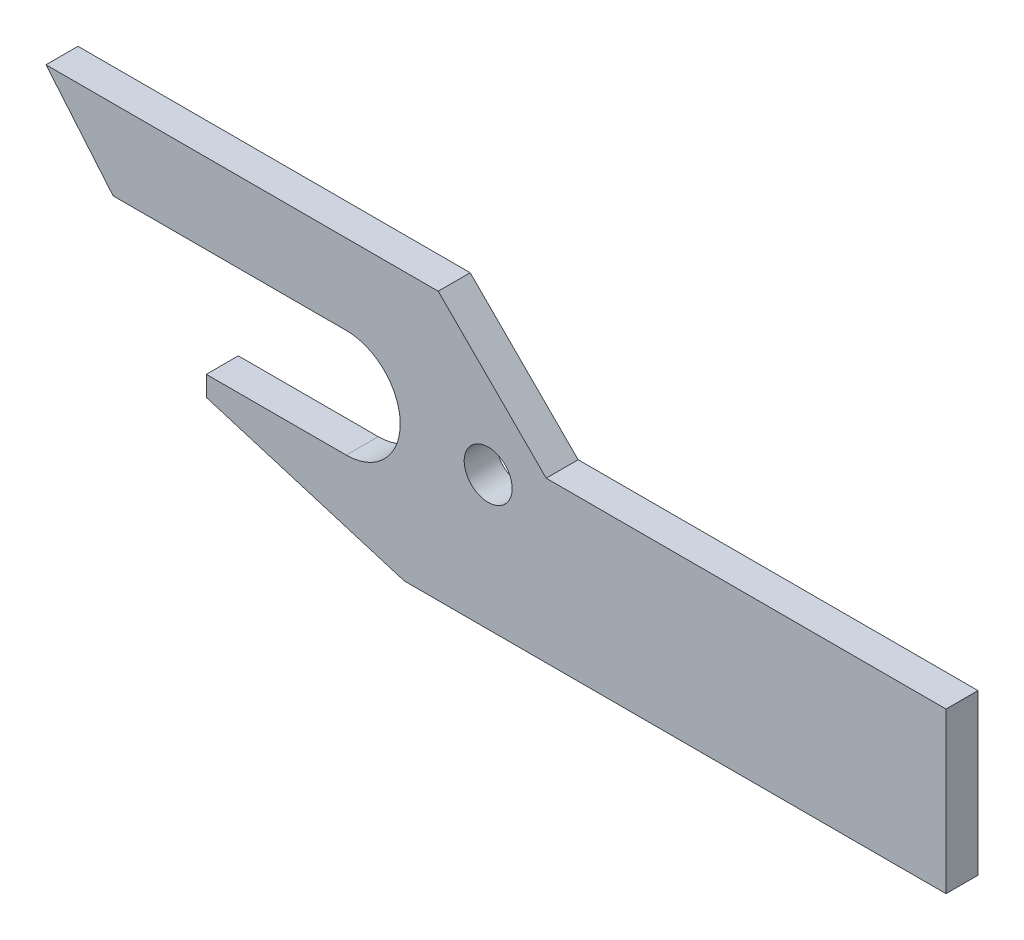
ISO-10303-21;
HEADER;
FILE_DESCRIPTION(('STEP AP214'),'2;1');
FILE_NAME('part.step','',(''),(''),'','','');
FILE_SCHEMA(('AUTOMOTIVE_DESIGN { 1 0 10303 214 1 1 1 1 }'));
ENDSEC;
DATA;
#1=APPLICATION_CONTEXT('core data for automotive mechanical design processes');
#2=APPLICATION_PROTOCOL_DEFINITION('international standard','automotive_design',2000,#1);
#3=PRODUCT_CONTEXT('',#1,'mechanical');
#4=PRODUCT('Part','Part','',(#3));
#5=PRODUCT_RELATED_PRODUCT_CATEGORY('part','',(#4));
#6=PRODUCT_DEFINITION_FORMATION('','',#4);
#7=PRODUCT_DEFINITION_CONTEXT('part definition',#1,'design');
#8=PRODUCT_DEFINITION('design','',#6,#7);
#9=PRODUCT_DEFINITION_SHAPE('','',#8);
#10=(LENGTH_UNIT() NAMED_UNIT(*) SI_UNIT(.MILLI.,.METRE.));
#11=(NAMED_UNIT(*) PLANE_ANGLE_UNIT() SI_UNIT($,.RADIAN.));
#12=(NAMED_UNIT(*) SI_UNIT($,.STERADIAN.) SOLID_ANGLE_UNIT());
#13=UNCERTAINTY_MEASURE_WITH_UNIT(LENGTH_MEASURE(1.E-05),#10,'distance_accuracy_value','');
#14=(GEOMETRIC_REPRESENTATION_CONTEXT(3) GLOBAL_UNCERTAINTY_ASSIGNED_CONTEXT((#13)) GLOBAL_UNIT_ASSIGNED_CONTEXT((#10,
#11,#12)) REPRESENTATION_CONTEXT('',''));
#15=CARTESIAN_POINT('',(0.,0.,0.));
#16=DIRECTION('',(0.,0.,1.));
#17=DIRECTION('',(1.,0.,0.));
#18=AXIS2_PLACEMENT_3D('',#15,#16,#17);
#19=CARTESIAN_POINT('',(-35.,-18.5,-8.));
#20=DIRECTION('',(-1.,0.,0.));
#21=DIRECTION('',(0.,-1.,0.));
#22=AXIS2_PLACEMENT_3D('',#19,#20,#21);
#23=PLANE('',#22);
#24=DIRECTION('',(0.,-1.,0.));
#25=VECTOR('',#24,1.);
#26=CARTESIAN_POINT('',(-35.,-18.5,0.));
#27=LINE('',#26,#25);
#28=CARTESIAN_POINT('',(-35.,-13.5,0.));
#29=VERTEX_POINT('',#28);
#30=CARTESIAN_POINT('',(-35.,-18.5,0.));
#31=VERTEX_POINT('',#30);
#32=EDGE_CURVE('E152',#29,#31,#27,.T.);
#33=ORIENTED_EDGE('',*,*,#32,.F.);
#34=DIRECTION('',(0.,0.,1.));
#35=VECTOR('',#34,1.);
#36=CARTESIAN_POINT('',(-35.,-13.5,-8.));
#37=LINE('',#36,#35);
#38=CARTESIAN_POINT('',(-35.,-13.5,-8.));
#39=VERTEX_POINT('',#38);
#40=EDGE_CURVE('E11',#39,#29,#37,.T.);
#41=ORIENTED_EDGE('',*,*,#40,.F.);
#42=DIRECTION('',(0.,-1.,0.));
#43=VECTOR('',#42,1.);
#44=CARTESIAN_POINT('',(-35.,-18.5,-8.));
#45=LINE('',#44,#43);
#46=CARTESIAN_POINT('',(-35.,-18.5,-8.));
#47=VERTEX_POINT('',#46);
#48=EDGE_CURVE('E182',#39,#47,#45,.T.);
#49=ORIENTED_EDGE('',*,*,#48,.T.);
#50=DIRECTION('',(0.,0.,1.));
#51=VECTOR('',#50,1.);
#52=CARTESIAN_POINT('',(-35.,-18.5,-8.));
#53=LINE('',#52,#51);
#54=EDGE_CURVE('E40',#47,#31,#53,.T.);
#55=ORIENTED_EDGE('',*,*,#54,.T.);
#56=EDGE_LOOP('',(#33,#41,#49,#55));
#57=FACE_BOUND('',#56,.T.);
#58=ADVANCED_FACE('F37',(#57),#23,.T.);
#59=CARTESIAN_POINT('',(-35.,-13.5,-8.));
#60=DIRECTION('',(0.,1.,0.));
#61=DIRECTION('',(-1.,0.,0.));
#62=AXIS2_PLACEMENT_3D('',#59,#60,#61);
#63=PLANE('',#62);
#64=DIRECTION('',(-1.,0.,0.));
#65=VECTOR('',#64,1.);
#66=CARTESIAN_POINT('',(-35.,-13.5,0.));
#67=LINE('',#66,#65);
#68=CARTESIAN_POINT('',(-2.27318164292001E-11,-13.5,0.));
#69=VERTEX_POINT('',#68);
#70=EDGE_CURVE('E180',#69,#29,#67,.T.);
#71=ORIENTED_EDGE('',*,*,#70,.F.);
#72=DIRECTION('',(0.,0.,1.));
#73=VECTOR('',#72,1.);
#74=CARTESIAN_POINT('',(-2.27318164292001E-11,-13.5,-8.));
#75=LINE('',#74,#73);
#76=CARTESIAN_POINT('',(-2.27318164292001E-11,-13.5,-8.));
#77=VERTEX_POINT('',#76);
#78=EDGE_CURVE('E46',#77,#69,#75,.T.);
#79=ORIENTED_EDGE('',*,*,#78,.F.);
#80=DIRECTION('',(-1.,0.,0.));
#81=VECTOR('',#80,1.);
#82=CARTESIAN_POINT('',(-35.,-13.5,-8.));
#83=LINE('',#82,#81);
#84=EDGE_CURVE('E142',#77,#39,#83,.T.);
#85=ORIENTED_EDGE('',*,*,#84,.T.);
#86=ORIENTED_EDGE('',*,*,#40,.T.);
#87=EDGE_LOOP('',(#71,#79,#85,#86));
#88=FACE_BOUND('',#87,.T.);
#89=ADVANCED_FACE('F200',(#88),#63,.T.);
#90=CARTESIAN_POINT('',(0.,0.,-8.));
#91=DIRECTION('',(0.,0.,1.));
#92=DIRECTION('',(1.,0.,0.));
#93=AXIS2_PLACEMENT_3D('',#90,#91,#92);
#94=CYLINDRICAL_SURFACE('',#93,13.5);
#95=CARTESIAN_POINT('',(0.,0.,0.));
#96=DIRECTION('',(0.,0.,-1.));
#97=DIRECTION('',(1.,0.,0.));
#98=AXIS2_PLACEMENT_3D('',#95,#96,#97);
#99=CIRCLE('',#98,13.5);
#100=CARTESIAN_POINT('',(0.,13.5,0.));
#101=VERTEX_POINT('',#100);
#102=EDGE_CURVE('E129',#101,#69,#99,.T.);
#103=ORIENTED_EDGE('',*,*,#102,.F.);
#104=DIRECTION('',(0.,0.,1.));
#105=VECTOR('',#104,1.);
#106=CARTESIAN_POINT('',(0.,13.5,-8.));
#107=LINE('',#106,#105);
#108=CARTESIAN_POINT('',(0.,13.5,-8.));
#109=VERTEX_POINT('',#108);
#110=EDGE_CURVE('E124',#109,#101,#107,.T.);
#111=ORIENTED_EDGE('',*,*,#110,.F.);
#112=CARTESIAN_POINT('',(0.,0.,-8.));
#113=DIRECTION('',(0.,0.,-1.));
#114=DIRECTION('',(1.,0.,0.));
#115=AXIS2_PLACEMENT_3D('',#112,#113,#114);
#116=CIRCLE('',#115,13.5);
#117=EDGE_CURVE('E127',#109,#77,#116,.T.);
#118=ORIENTED_EDGE('',*,*,#117,.T.);
#119=ORIENTED_EDGE('',*,*,#78,.T.);
#120=EDGE_LOOP('',(#103,#111,#118,#119));
#121=FACE_BOUND('',#120,.T.);
#122=ADVANCED_FACE('F126',(#121),#94,.F.);
#123=CARTESIAN_POINT('',(0.,13.5,-8.));
#124=DIRECTION('',(0.,-1.,0.));
#125=DIRECTION('',(1.,0.,0.));
#126=AXIS2_PLACEMENT_3D('',#123,#124,#125);
#127=PLANE('',#126);
#128=DIRECTION('',(1.,0.,0.));
#129=VECTOR('',#128,1.);
#130=CARTESIAN_POINT('',(0.,13.5,0.));
#131=LINE('',#130,#129);
#132=CARTESIAN_POINT('',(-58.3086310843706,13.5,0.));
#133=VERTEX_POINT('',#132);
#134=EDGE_CURVE('E177',#133,#101,#131,.T.);
#135=ORIENTED_EDGE('',*,*,#134,.F.);
#136=DIRECTION('',(0.,0.,1.));
#137=VECTOR('',#136,1.);
#138=CARTESIAN_POINT('',(-58.3086310843706,13.5,-8.));
#139=LINE('',#138,#137);
#140=CARTESIAN_POINT('',(-58.3086310843706,13.5,-8.));
#141=VERTEX_POINT('',#140);
#142=EDGE_CURVE('E134',#141,#133,#139,.T.);
#143=ORIENTED_EDGE('',*,*,#142,.F.);
#144=DIRECTION('',(1.,0.,0.));
#145=VECTOR('',#144,1.);
#146=CARTESIAN_POINT('',(0.,13.5,-8.));
#147=LINE('',#146,#145);
#148=EDGE_CURVE('E140',#141,#109,#147,.T.);
#149=ORIENTED_EDGE('',*,*,#148,.T.);
#150=ORIENTED_EDGE('',*,*,#110,.T.);
#151=EDGE_LOOP('',(#135,#143,#149,#150));
#152=FACE_BOUND('',#151,.T.);
#153=ADVANCED_FACE('F144',(#152),#127,.T.);
#154=CARTESIAN_POINT('',(-58.3086310843706,13.5,-8.));
#155=DIRECTION('',(-0.766044443118974,-0.642787609686544,0.));
#156=DIRECTION('',(0.642787609686544,-0.766044443118974,0.));
#157=AXIS2_PLACEMENT_3D('',#154,#155,#156);
#158=PLANE('',#157);
#159=DIRECTION('',(0.642787609686544,-0.766044443118974,0.));
#160=VECTOR('',#159,1.);
#161=CARTESIAN_POINT('',(-58.3086310843706,13.5,0.));
#162=LINE('',#161,#160);
#163=CARTESIAN_POINT('',(-75.0906237078958,33.4999999999755,0.));
#164=VERTEX_POINT('',#163);
#165=EDGE_CURVE('E174',#164,#133,#162,.T.);
#166=ORIENTED_EDGE('',*,*,#165,.F.);
#167=DIRECTION('',(0.,0.,1.));
#168=VECTOR('',#167,1.);
#169=CARTESIAN_POINT('',(-75.0906237078958,33.4999999999755,-8.));
#170=LINE('',#169,#168);
#171=CARTESIAN_POINT('',(-75.0906237078958,33.4999999999755,-8.));
#172=VERTEX_POINT('',#171);
#173=EDGE_CURVE('E186',#172,#164,#170,.T.);
#174=ORIENTED_EDGE('',*,*,#173,.F.);
#175=DIRECTION('',(0.642787609686544,-0.766044443118974,0.));
#176=VECTOR('',#175,1.);
#177=CARTESIAN_POINT('',(-58.3086310843706,13.5,-8.));
#178=LINE('',#177,#176);
#179=EDGE_CURVE('E145',#172,#141,#178,.T.);
#180=ORIENTED_EDGE('',*,*,#179,.T.);
#181=ORIENTED_EDGE('',*,*,#142,.T.);
#182=EDGE_LOOP('',(#166,#174,#180,#181));
#183=FACE_BOUND('',#182,.T.);
#184=ADVANCED_FACE('F213',(#183),#158,.T.);
#185=CARTESIAN_POINT('',(-75.0906237078958,33.4999999999755,-8.));
#186=DIRECTION('',(0.,1.,0.));
#187=DIRECTION('',(0.,0.,1.));
#188=AXIS2_PLACEMENT_3D('',#185,#186,#187);
#189=PLANE('',#188);
#190=DIRECTION('',(-1.,0.,0.));
#191=VECTOR('',#190,1.);
#192=CARTESIAN_POINT('',(-75.0906237078958,33.4999999999755,0.));
#193=LINE('',#192,#191);
#194=CARTESIAN_POINT('',(23.0000000000492,33.4999999999755,0.));
#195=VERTEX_POINT('',#194);
#196=EDGE_CURVE('E171',#195,#164,#193,.T.);
#197=ORIENTED_EDGE('',*,*,#196,.F.);
#198=DIRECTION('',(0.,0.,1.));
#199=VECTOR('',#198,1.);
#200=CARTESIAN_POINT('',(23.0000000000492,33.4999999999755,-8.));
#201=LINE('',#200,#199);
#202=CARTESIAN_POINT('',(23.0000000000492,33.4999999999755,-8.));
#203=VERTEX_POINT('',#202);
#204=EDGE_CURVE('E188',#203,#195,#201,.T.);
#205=ORIENTED_EDGE('',*,*,#204,.F.);
#206=DIRECTION('',(-1.,0.,0.));
#207=VECTOR('',#206,1.);
#208=CARTESIAN_POINT('',(-75.0906237078958,33.4999999999755,-8.));
#209=LINE('',#208,#207);
#210=EDGE_CURVE('E147',#203,#172,#209,.T.);
#211=ORIENTED_EDGE('',*,*,#210,.T.);
#212=ORIENTED_EDGE('',*,*,#173,.T.);
#213=EDGE_LOOP('',(#197,#205,#211,#212));
#214=FACE_BOUND('',#213,.T.);
#215=ADVANCED_FACE('F216',(#214),#189,.T.);
#216=CARTESIAN_POINT('',(23.0000000000492,33.4999999999755,-8.));
#217=DIRECTION('',(0.707106781186549,0.707106781186546,0.));
#218=DIRECTION('',(-0.707106781186546,0.707106781186549,0.));
#219=AXIS2_PLACEMENT_3D('',#216,#217,#218);
#220=PLANE('',#219);
#221=DIRECTION('',(-0.707106781186546,0.707106781186549,0.));
#222=VECTOR('',#221,1.);
#223=CARTESIAN_POINT('',(23.0000000000492,33.4999999999755,0.));
#224=LINE('',#223,#222);
#225=CARTESIAN_POINT('',(50.,6.50000000002454,0.));
#226=VERTEX_POINT('',#225);
#227=EDGE_CURVE('E168',#226,#195,#224,.T.);
#228=ORIENTED_EDGE('',*,*,#227,.F.);
#229=DIRECTION('',(0.,0.,1.));
#230=VECTOR('',#229,1.);
#231=CARTESIAN_POINT('',(50.,6.50000000002454,-8.));
#232=LINE('',#231,#230);
#233=CARTESIAN_POINT('',(50.,6.50000000002454,-8.));
#234=VERTEX_POINT('',#233);
#235=EDGE_CURVE('E190',#234,#226,#232,.T.);
#236=ORIENTED_EDGE('',*,*,#235,.F.);
#237=DIRECTION('',(-0.707106781186546,0.707106781186549,0.));
#238=VECTOR('',#237,1.);
#239=CARTESIAN_POINT('',(23.0000000000492,33.4999999999755,-8.));
#240=LINE('',#239,#238);
#241=EDGE_CURVE('E272',#234,#203,#240,.T.);
#242=ORIENTED_EDGE('',*,*,#241,.T.);
#243=ORIENTED_EDGE('',*,*,#204,.T.);
#244=EDGE_LOOP('',(#228,#236,#242,#243));
#245=FACE_BOUND('',#244,.T.);
#246=ADVANCED_FACE('F220',(#245),#220,.T.);
#247=CARTESIAN_POINT('',(50.,6.50000000002454,-8.));
#248=DIRECTION('',(0.,1.,0.));
#249=DIRECTION('',(-1.,0.,0.));
#250=AXIS2_PLACEMENT_3D('',#247,#248,#249);
#251=PLANE('',#250);
#252=DIRECTION('',(-1.,0.,0.));
#253=VECTOR('',#252,1.);
#254=CARTESIAN_POINT('',(50.,6.50000000002454,0.));
#255=LINE('',#254,#253);
#256=CARTESIAN_POINT('',(149.99999999996,6.50000000002338,0.));
#257=VERTEX_POINT('',#256);
#258=EDGE_CURVE('E165',#257,#226,#255,.T.);
#259=ORIENTED_EDGE('',*,*,#258,.F.);
#260=DIRECTION('',(0.,0.,1.));
#261=VECTOR('',#260,1.);
#262=CARTESIAN_POINT('',(149.99999999996,6.50000000002338,-8.));
#263=LINE('',#262,#261);
#264=CARTESIAN_POINT('',(149.99999999996,6.50000000002338,-8.));
#265=VERTEX_POINT('',#264);
#266=EDGE_CURVE('E192',#265,#257,#263,.T.);
#267=ORIENTED_EDGE('',*,*,#266,.F.);
#268=DIRECTION('',(-1.,0.,0.));
#269=VECTOR('',#268,1.);
#270=CARTESIAN_POINT('',(50.,6.50000000002454,-8.));
#271=LINE('',#270,#269);
#272=EDGE_CURVE('E269',#265,#234,#271,.T.);
#273=ORIENTED_EDGE('',*,*,#272,.T.);
#274=ORIENTED_EDGE('',*,*,#235,.T.);
#275=EDGE_LOOP('',(#259,#267,#273,#274));
#276=FACE_BOUND('',#275,.T.);
#277=ADVANCED_FACE('F224',(#276),#251,.T.);
#278=CARTESIAN_POINT('',(149.99999999996,6.50000000002338,-8.));
#279=DIRECTION('',(1.,0.,0.));
#280=DIRECTION('',(0.,0.,-1.));
#281=AXIS2_PLACEMENT_3D('',#278,#279,#280);
#282=PLANE('',#281);
#283=DIRECTION('',(0.,1.,0.));
#284=VECTOR('',#283,1.);
#285=CARTESIAN_POINT('',(149.99999999996,6.50000000002338,0.));
#286=LINE('',#285,#284);
#287=CARTESIAN_POINT('',(149.99999999996,-33.4999999999766,0.));
#288=VERTEX_POINT('',#287);
#289=EDGE_CURVE('E162',#288,#257,#286,.T.);
#290=ORIENTED_EDGE('',*,*,#289,.F.);
#291=DIRECTION('',(0.,0.,1.));
#292=VECTOR('',#291,1.);
#293=CARTESIAN_POINT('',(149.99999999996,-33.4999999999766,-8.));
#294=LINE('',#293,#292);
#295=CARTESIAN_POINT('',(149.99999999996,-33.4999999999766,-8.));
#296=VERTEX_POINT('',#295);
#297=EDGE_CURVE('E194',#296,#288,#294,.T.);
#298=ORIENTED_EDGE('',*,*,#297,.F.);
#299=DIRECTION('',(0.,1.,0.));
#300=VECTOR('',#299,1.);
#301=CARTESIAN_POINT('',(149.99999999996,6.50000000002338,-8.));
#302=LINE('',#301,#300);
#303=EDGE_CURVE('E266',#296,#265,#302,.T.);
#304=ORIENTED_EDGE('',*,*,#303,.T.);
#305=ORIENTED_EDGE('',*,*,#266,.T.);
#306=EDGE_LOOP('',(#290,#298,#304,#305));
#307=FACE_BOUND('',#306,.T.);
#308=ADVANCED_FACE('F228',(#307),#282,.T.);
#309=CARTESIAN_POINT('',(149.99999999996,-33.4999999999766,-8.));
#310=DIRECTION('',(0.,-1.,0.));
#311=DIRECTION('',(1.,0.,0.));
#312=AXIS2_PLACEMENT_3D('',#309,#310,#311);
#313=PLANE('',#312);
#314=DIRECTION('',(1.,0.,0.));
#315=VECTOR('',#314,1.);
#316=CARTESIAN_POINT('',(149.99999999996,-33.4999999999766,0.));
#317=LINE('',#316,#315);
#318=CARTESIAN_POINT('',(14.5,-33.4999999999755,0.));
#319=VERTEX_POINT('',#318);
#320=EDGE_CURVE('E159',#319,#288,#317,.T.);
#321=ORIENTED_EDGE('',*,*,#320,.F.);
#322=DIRECTION('',(0.,0.,1.));
#323=VECTOR('',#322,1.);
#324=CARTESIAN_POINT('',(14.5,-33.4999999999755,-8.));
#325=LINE('',#324,#323);
#326=CARTESIAN_POINT('',(14.5,-33.4999999999755,-8.));
#327=VERTEX_POINT('',#326);
#328=EDGE_CURVE('E195',#327,#319,#325,.T.);
#329=ORIENTED_EDGE('',*,*,#328,.F.);
#330=DIRECTION('',(1.,0.,0.));
#331=VECTOR('',#330,1.);
#332=CARTESIAN_POINT('',(149.99999999996,-33.4999999999766,-8.));
#333=LINE('',#332,#331);
#334=EDGE_CURVE('E263',#327,#296,#333,.T.);
#335=ORIENTED_EDGE('',*,*,#334,.T.);
#336=ORIENTED_EDGE('',*,*,#297,.T.);
#337=EDGE_LOOP('',(#321,#329,#335,#336));
#338=FACE_BOUND('',#337,.T.);
#339=ADVANCED_FACE('F232',(#338),#313,.T.);
#340=CARTESIAN_POINT('',(14.5,-33.4999999999755,-8.));
#341=DIRECTION('',(-0.290007395282436,-0.957024404433605,0.));
#342=DIRECTION('',(0.957024404433605,-0.290007395282436,0.));
#343=AXIS2_PLACEMENT_3D('',#340,#341,#342);
#344=PLANE('',#343);
#345=DIRECTION('',(0.957024404433605,-0.290007395282436,0.));
#346=VECTOR('',#345,1.);
#347=CARTESIAN_POINT('',(14.5,-33.4999999999755,0.));
#348=LINE('',#347,#346);
#349=EDGE_CURVE('E155',#31,#319,#348,.T.);
#350=ORIENTED_EDGE('',*,*,#349,.F.);
#351=ORIENTED_EDGE('',*,*,#54,.F.);
#352=DIRECTION('',(0.957024404433605,-0.290007395282436,0.));
#353=VECTOR('',#352,1.);
#354=CARTESIAN_POINT('',(14.5,-33.4999999999755,-8.));
#355=LINE('',#354,#353);
#356=EDGE_CURVE('E261',#47,#327,#355,.T.);
#357=ORIENTED_EDGE('',*,*,#356,.T.);
#358=ORIENTED_EDGE('',*,*,#328,.T.);
#359=EDGE_LOOP('',(#350,#351,#357,#358));
#360=FACE_BOUND('',#359,.T.);
#361=ADVANCED_FACE('F197',(#360),#344,.T.);
#362=CARTESIAN_POINT('',(0.,0.,-8.));
#363=DIRECTION('',(0.,0.,1.));
#364=DIRECTION('',(1.,0.,0.));
#365=AXIS2_PLACEMENT_3D('',#362,#363,#364);
#366=PLANE('',#365);
#367=CARTESIAN_POINT('',(35.5,0.,-8.));
#368=DIRECTION('',(0.,0.,1.));
#369=DIRECTION('',(1.,0.,0.));
#370=AXIS2_PLACEMENT_3D('',#367,#368,#369);
#371=CIRCLE('',#370,6.);
#372=CARTESIAN_POINT('',(41.5,0.,-8.));
#373=VERTEX_POINT('',#372);
#374=EDGE_CURVE('E156',#373,#373,#371,.T.);
#375=ORIENTED_EDGE('',*,*,#374,.T.);
#376=EDGE_LOOP('',(#375));
#377=FACE_BOUND('',#376,.T.);
#378=ORIENTED_EDGE('',*,*,#48,.F.);
#379=ORIENTED_EDGE('',*,*,#84,.F.);
#380=ORIENTED_EDGE('',*,*,#117,.F.);
#381=ORIENTED_EDGE('',*,*,#148,.F.);
#382=ORIENTED_EDGE('',*,*,#179,.F.);
#383=ORIENTED_EDGE('',*,*,#210,.F.);
#384=ORIENTED_EDGE('',*,*,#241,.F.);
#385=ORIENTED_EDGE('',*,*,#272,.F.);
#386=ORIENTED_EDGE('',*,*,#303,.F.);
#387=ORIENTED_EDGE('',*,*,#334,.F.);
#388=ORIENTED_EDGE('',*,*,#356,.F.);
#389=EDGE_LOOP('',(#378,#379,#380,#381,#382,#383,#384,#385,#386,#387,#388));
#390=FACE_BOUND('',#389,.T.);
#391=ADVANCED_FACE('F138',(#377,#390),#366,.F.);
#392=CARTESIAN_POINT('',(0.,0.,0.));
#393=DIRECTION('',(0.,0.,1.));
#394=DIRECTION('',(1.,0.,0.));
#395=AXIS2_PLACEMENT_3D('',#392,#393,#394);
#396=PLANE('',#395);
#397=CARTESIAN_POINT('',(35.5,0.,0.));
#398=DIRECTION('',(0.,0.,1.));
#399=DIRECTION('',(1.,0.,0.));
#400=AXIS2_PLACEMENT_3D('',#397,#398,#399);
#401=CIRCLE('',#400,6.);
#402=CARTESIAN_POINT('',(41.5,0.,0.));
#403=VERTEX_POINT('',#402);
#404=EDGE_CURVE('E256',#403,#403,#401,.T.);
#405=ORIENTED_EDGE('',*,*,#404,.F.);
#406=EDGE_LOOP('',(#405));
#407=FACE_BOUND('',#406,.T.);
#408=ORIENTED_EDGE('',*,*,#32,.T.);
#409=ORIENTED_EDGE('',*,*,#349,.T.);
#410=ORIENTED_EDGE('',*,*,#320,.T.);
#411=ORIENTED_EDGE('',*,*,#289,.T.);
#412=ORIENTED_EDGE('',*,*,#258,.T.);
#413=ORIENTED_EDGE('',*,*,#227,.T.);
#414=ORIENTED_EDGE('',*,*,#196,.T.);
#415=ORIENTED_EDGE('',*,*,#165,.T.);
#416=ORIENTED_EDGE('',*,*,#134,.T.);
#417=ORIENTED_EDGE('',*,*,#102,.T.);
#418=ORIENTED_EDGE('',*,*,#70,.T.);
#419=EDGE_LOOP('',(#408,#409,#410,#411,#412,#413,#414,#415,#416,#417,#418));
#420=FACE_BOUND('',#419,.T.);
#421=ADVANCED_FACE('F199',(#407,#420),#396,.T.);
#422=CARTESIAN_POINT('',(35.5,0.,-8.));
#423=DIRECTION('',(0.,0.,1.));
#424=DIRECTION('',(1.,0.,0.));
#425=AXIS2_PLACEMENT_3D('',#422,#423,#424);
#426=CYLINDRICAL_SURFACE('',#425,6.);
#427=ORIENTED_EDGE('',*,*,#374,.F.);
#428=EDGE_LOOP('',(#427));
#429=FACE_BOUND('',#428,.T.);
#430=ORIENTED_EDGE('',*,*,#404,.T.);
#431=EDGE_LOOP('',(#430));
#432=FACE_BOUND('',#431,.T.);
#433=ADVANCED_FACE('F244',(#429,#432),#426,.F.);
#434=CLOSED_SHELL('',(#58,#89,#122,#153,#184,#215,#246,#277,#308,#339,#361,#391,#421,#433));
#435=MANIFOLD_SOLID_BREP('B2',#434);
#436=ADVANCED_BREP_SHAPE_REPRESENTATION('',(#18,#435),#14);
#437=SHAPE_DEFINITION_REPRESENTATION(#9,#436);
ENDSEC;
END-ISO-10303-21;
